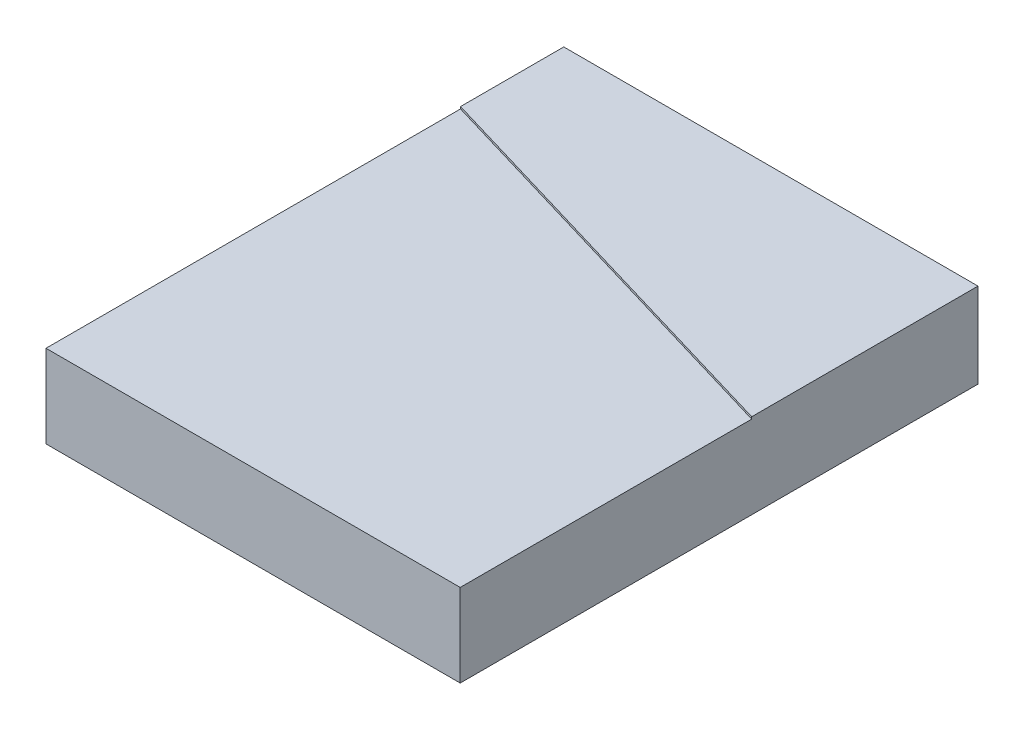
ISO-10303-21;
HEADER;
FILE_DESCRIPTION(('STEP AP214'),'2;1');
FILE_NAME('part.step','',(''),(''),'','','');
FILE_SCHEMA(('AUTOMOTIVE_DESIGN { 1 0 10303 214 1 1 1 1 }'));
ENDSEC;
DATA;
#1=APPLICATION_CONTEXT('core data for automotive mechanical design processes');
#2=APPLICATION_PROTOCOL_DEFINITION('international standard','automotive_design',2000,#1);
#3=PRODUCT_CONTEXT('',#1,'mechanical');
#4=PRODUCT('Part','Part','',(#3));
#5=PRODUCT_RELATED_PRODUCT_CATEGORY('part','',(#4));
#6=PRODUCT_DEFINITION_FORMATION('','',#4);
#7=PRODUCT_DEFINITION_CONTEXT('part definition',#1,'design');
#8=PRODUCT_DEFINITION('design','',#6,#7);
#9=PRODUCT_DEFINITION_SHAPE('','',#8);
#10=(LENGTH_UNIT() NAMED_UNIT(*) SI_UNIT(.MILLI.,.METRE.));
#11=(NAMED_UNIT(*) PLANE_ANGLE_UNIT() SI_UNIT($,.RADIAN.));
#12=(NAMED_UNIT(*) SI_UNIT($,.STERADIAN.) SOLID_ANGLE_UNIT());
#13=UNCERTAINTY_MEASURE_WITH_UNIT(LENGTH_MEASURE(1.E-05),#10,'distance_accuracy_value','');
#14=(GEOMETRIC_REPRESENTATION_CONTEXT(3) GLOBAL_UNCERTAINTY_ASSIGNED_CONTEXT((#13)) GLOBAL_UNIT_ASSIGNED_CONTEXT((#10,
#11,#12)) REPRESENTATION_CONTEXT('',''));
#15=CARTESIAN_POINT('',(0.,0.,0.));
#16=DIRECTION('',(0.,0.,1.));
#17=DIRECTION('',(1.,0.,0.));
#18=AXIS2_PLACEMENT_3D('',#15,#16,#17);
#19=CARTESIAN_POINT('',(-10.,4.,-12.5));
#20=DIRECTION('',(1.,0.,0.));
#21=DIRECTION('',(0.,0.,-1.));
#22=AXIS2_PLACEMENT_3D('',#19,#20,#21);
#23=PLANE('',#22);
#24=DIRECTION('',(0.,0.,1.));
#25=VECTOR('',#24,1.);
#26=CARTESIAN_POINT('',(-10.,0.,-12.5));
#27=LINE('',#26,#25);
#28=CARTESIAN_POINT('',(-10.,0.,-12.5));
#29=VERTEX_POINT('',#28);
#30=CARTESIAN_POINT('',(-10.,0.,12.5));
#31=VERTEX_POINT('',#30);
#32=EDGE_CURVE('E97',#29,#31,#27,.T.);
#33=ORIENTED_EDGE('',*,*,#32,.T.);
#34=DIRECTION('',(0.,-1.,0.));
#35=VECTOR('',#34,1.);
#36=CARTESIAN_POINT('',(-10.,4.,12.5));
#37=LINE('',#36,#35);
#38=CARTESIAN_POINT('',(-10.,4.,12.5));
#39=VERTEX_POINT('',#38);
#40=EDGE_CURVE('E11',#39,#31,#37,.T.);
#41=ORIENTED_EDGE('',*,*,#40,.F.);
#42=DIRECTION('',(0.,0.,1.));
#43=VECTOR('',#42,1.);
#44=CARTESIAN_POINT('',(-10.,4.,-12.5));
#45=LINE('',#44,#43);
#46=CARTESIAN_POINT('',(-10.,4.,-7.51464667399659));
#47=VERTEX_POINT('',#46);
#48=EDGE_CURVE('E91',#47,#39,#45,.T.);
#49=ORIENTED_EDGE('',*,*,#48,.F.);
#50=DIRECTION('',(0.,-1.,0.));
#51=VECTOR('',#50,1.);
#52=CARTESIAN_POINT('',(-10.,4.1,-7.51464667399659));
#53=LINE('',#52,#51);
#54=CARTESIAN_POINT('',(-10.,4.1,-7.51464667399659));
#55=VERTEX_POINT('',#54);
#56=EDGE_CURVE('E106',#55,#47,#53,.T.);
#57=ORIENTED_EDGE('',*,*,#56,.F.);
#58=DIRECTION('',(0.,0.,1.));
#59=VECTOR('',#58,1.);
#60=CARTESIAN_POINT('',(-10.,4.1,-12.5));
#61=LINE('',#60,#59);
#62=CARTESIAN_POINT('',(-10.,4.1,-12.5));
#63=VERTEX_POINT('',#62);
#64=EDGE_CURVE('E100',#63,#55,#61,.T.);
#65=ORIENTED_EDGE('',*,*,#64,.F.);
#66=DIRECTION('',(0.,-1.,0.));
#67=VECTOR('',#66,1.);
#68=CARTESIAN_POINT('',(-10.,4.,-12.5));
#69=LINE('',#68,#67);
#70=EDGE_CURVE('E84',#63,#29,#69,.T.);
#71=ORIENTED_EDGE('',*,*,#70,.T.);
#72=EDGE_LOOP('',(#33,#41,#49,#57,#65,#71));
#73=FACE_BOUND('',#72,.T.);
#74=ADVANCED_FACE('F37',(#73),#23,.F.);
#75=CARTESIAN_POINT('',(-10.,4.,12.5));
#76=DIRECTION('',(0.,0.,-1.));
#77=DIRECTION('',(-1.,0.,0.));
#78=AXIS2_PLACEMENT_3D('',#75,#76,#77);
#79=PLANE('',#78);
#80=DIRECTION('',(1.,0.,0.));
#81=VECTOR('',#80,1.);
#82=CARTESIAN_POINT('',(-10.,0.,12.5));
#83=LINE('',#82,#81);
#84=CARTESIAN_POINT('',(10.,0.,12.5));
#85=VERTEX_POINT('',#84);
#86=EDGE_CURVE('E105',#31,#85,#83,.T.);
#87=ORIENTED_EDGE('',*,*,#86,.T.);
#88=DIRECTION('',(0.,-1.,0.));
#89=VECTOR('',#88,1.);
#90=CARTESIAN_POINT('',(10.,4.,12.5));
#91=LINE('',#90,#89);
#92=CARTESIAN_POINT('',(10.,4.,12.5));
#93=VERTEX_POINT('',#92);
#94=EDGE_CURVE('E45',#93,#85,#91,.T.);
#95=ORIENTED_EDGE('',*,*,#94,.F.);
#96=DIRECTION('',(1.,0.,0.));
#97=VECTOR('',#96,1.);
#98=CARTESIAN_POINT('',(-10.,4.,12.5));
#99=LINE('',#98,#97);
#100=EDGE_CURVE('E59',#39,#93,#99,.T.);
#101=ORIENTED_EDGE('',*,*,#100,.F.);
#102=ORIENTED_EDGE('',*,*,#40,.T.);
#103=EDGE_LOOP('',(#87,#95,#101,#102));
#104=FACE_BOUND('',#103,.T.);
#105=ADVANCED_FACE('F157',(#104),#79,.F.);
#106=CARTESIAN_POINT('',(10.,4.,-12.5));
#107=DIRECTION('',(-1.,0.,0.));
#108=DIRECTION('',(0.,0.,1.));
#109=AXIS2_PLACEMENT_3D('',#106,#107,#108);
#110=PLANE('',#109);
#111=DIRECTION('',(0.,0.,-1.));
#112=VECTOR('',#111,1.);
#113=CARTESIAN_POINT('',(10.,0.,-12.5));
#114=LINE('',#113,#112);
#115=CARTESIAN_POINT('',(10.,0.,-12.5));
#116=VERTEX_POINT('',#115);
#117=EDGE_CURVE('E92',#85,#116,#114,.T.);
#118=ORIENTED_EDGE('',*,*,#117,.T.);
#119=DIRECTION('',(0.,-1.,0.));
#120=VECTOR('',#119,1.);
#121=CARTESIAN_POINT('',(10.,4.,-12.5));
#122=LINE('',#121,#120);
#123=CARTESIAN_POINT('',(10.,4.1,-12.5));
#124=VERTEX_POINT('',#123);
#125=EDGE_CURVE('E87',#124,#116,#122,.T.);
#126=ORIENTED_EDGE('',*,*,#125,.F.);
#127=DIRECTION('',(0.,0.,-1.));
#128=VECTOR('',#127,1.);
#129=CARTESIAN_POINT('',(10.,4.1,-1.57449965576006));
#130=LINE('',#129,#128);
#131=CARTESIAN_POINT('',(10.,4.1,-1.57449965576006));
#132=VERTEX_POINT('',#131);
#133=EDGE_CURVE('E140',#132,#124,#130,.T.);
#134=ORIENTED_EDGE('',*,*,#133,.F.);
#135=DIRECTION('',(0.,-1.,0.));
#136=VECTOR('',#135,1.);
#137=CARTESIAN_POINT('',(10.,4.1,-1.57449965576006));
#138=LINE('',#137,#136);
#139=CARTESIAN_POINT('',(10.,4.,-1.57449965576006));
#140=VERTEX_POINT('',#139);
#141=EDGE_CURVE('E110',#132,#140,#138,.T.);
#142=ORIENTED_EDGE('',*,*,#141,.T.);
#143=DIRECTION('',(0.,0.,-1.));
#144=VECTOR('',#143,1.);
#145=CARTESIAN_POINT('',(10.,4.,-12.5));
#146=LINE('',#145,#144);
#147=EDGE_CURVE('E102',#93,#140,#146,.T.);
#148=ORIENTED_EDGE('',*,*,#147,.F.);
#149=ORIENTED_EDGE('',*,*,#94,.T.);
#150=EDGE_LOOP('',(#118,#126,#134,#142,#148,#149));
#151=FACE_BOUND('',#150,.T.);
#152=ADVANCED_FACE('F138',(#151),#110,.F.);
#153=CARTESIAN_POINT('',(-10.,4.,-12.5));
#154=DIRECTION('',(0.,0.,1.));
#155=DIRECTION('',(1.,0.,0.));
#156=AXIS2_PLACEMENT_3D('',#153,#154,#155);
#157=PLANE('',#156);
#158=DIRECTION('',(-1.,0.,0.));
#159=VECTOR('',#158,1.);
#160=CARTESIAN_POINT('',(-10.,0.,-12.5));
#161=LINE('',#160,#159);
#162=EDGE_CURVE('E79',#116,#29,#161,.T.);
#163=ORIENTED_EDGE('',*,*,#162,.T.);
#164=ORIENTED_EDGE('',*,*,#70,.F.);
#165=DIRECTION('',(-1.,0.,0.));
#166=VECTOR('',#165,1.);
#167=CARTESIAN_POINT('',(10.,4.1,-12.5));
#168=LINE('',#167,#166);
#169=EDGE_CURVE('E137',#124,#63,#168,.T.);
#170=ORIENTED_EDGE('',*,*,#169,.F.);
#171=ORIENTED_EDGE('',*,*,#125,.T.);
#172=EDGE_LOOP('',(#163,#164,#170,#171));
#173=FACE_BOUND('',#172,.T.);
#174=ADVANCED_FACE('F81',(#173),#157,.F.);
#175=CARTESIAN_POINT('',(0.,4.,0.));
#176=DIRECTION('',(0.,1.,0.));
#177=DIRECTION('',(0.,0.,1.));
#178=AXIS2_PLACEMENT_3D('',#175,#176,#177);
#179=PLANE('',#178);
#180=DIRECTION('',(0.958612244465251,0.,0.284714883280264));
#181=VECTOR('',#180,1.);
#182=CARTESIAN_POINT('',(-10.,4.,-7.51464667399659));
#183=LINE('',#182,#181);
#184=EDGE_CURVE('E53',#47,#140,#183,.T.);
#185=ORIENTED_EDGE('',*,*,#184,.F.);
#186=ORIENTED_EDGE('',*,*,#48,.T.);
#187=ORIENTED_EDGE('',*,*,#100,.T.);
#188=ORIENTED_EDGE('',*,*,#147,.T.);
#189=EDGE_LOOP('',(#185,#186,#187,#188));
#190=FACE_BOUND('',#189,.T.);
#191=ADVANCED_FACE('F128',(#190),#179,.T.);
#192=CARTESIAN_POINT('',(0.,0.,0.));
#193=DIRECTION('',(0.,1.,0.));
#194=DIRECTION('',(0.,0.,1.));
#195=AXIS2_PLACEMENT_3D('',#192,#193,#194);
#196=PLANE('',#195);
#197=ORIENTED_EDGE('',*,*,#32,.F.);
#198=ORIENTED_EDGE('',*,*,#162,.F.);
#199=ORIENTED_EDGE('',*,*,#117,.F.);
#200=ORIENTED_EDGE('',*,*,#86,.F.);
#201=EDGE_LOOP('',(#197,#198,#199,#200));
#202=FACE_BOUND('',#201,.T.);
#203=ADVANCED_FACE('F104',(#202),#196,.F.);
#204=CARTESIAN_POINT('',(-10.,4.1,-7.51464667399659));
#205=DIRECTION('',(0.284714883280264,0.,-0.958612244465251));
#206=DIRECTION('',(-0.958612244465251,0.,-0.284714883280264));
#207=AXIS2_PLACEMENT_3D('',#204,#205,#206);
#208=PLANE('',#207);
#209=ORIENTED_EDGE('',*,*,#184,.T.);
#210=ORIENTED_EDGE('',*,*,#141,.F.);
#211=DIRECTION('',(0.958612244465251,0.,0.284714883280264));
#212=VECTOR('',#211,1.);
#213=CARTESIAN_POINT('',(-10.,4.1,-7.51464667399659));
#214=LINE('',#213,#212);
#215=EDGE_CURVE('E142',#55,#132,#214,.T.);
#216=ORIENTED_EDGE('',*,*,#215,.F.);
#217=ORIENTED_EDGE('',*,*,#56,.T.);
#218=EDGE_LOOP('',(#209,#210,#216,#217));
#219=FACE_BOUND('',#218,.T.);
#220=ADVANCED_FACE('F133',(#219),#208,.F.);
#221=CARTESIAN_POINT('',(0.,4.1,0.));
#222=DIRECTION('',(0.,1.,0.));
#223=DIRECTION('',(0.,0.,1.));
#224=AXIS2_PLACEMENT_3D('',#221,#222,#223);
#225=PLANE('',#224);
#226=ORIENTED_EDGE('',*,*,#169,.T.);
#227=ORIENTED_EDGE('',*,*,#64,.T.);
#228=ORIENTED_EDGE('',*,*,#215,.T.);
#229=ORIENTED_EDGE('',*,*,#133,.T.);
#230=EDGE_LOOP('',(#226,#227,#228,#229));
#231=FACE_BOUND('',#230,.T.);
#232=ADVANCED_FACE('F150',(#231),#225,.T.);
#233=CLOSED_SHELL('',(#74,#105,#152,#174,#191,#203,#220,#232));
#234=MANIFOLD_SOLID_BREP('B2',#233);
#235=ADVANCED_BREP_SHAPE_REPRESENTATION('',(#18,#234),#14);
#236=SHAPE_DEFINITION_REPRESENTATION(#9,#235);
ENDSEC;
END-ISO-10303-21;
